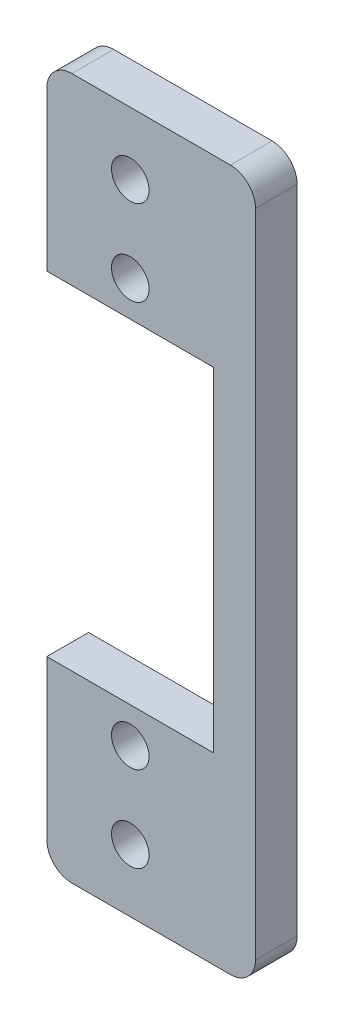
ISO-10303-21;
HEADER;
FILE_DESCRIPTION(('STEP AP214'),'2;1');
FILE_NAME('part.step','',(''),(''),'','','');
FILE_SCHEMA(('AUTOMOTIVE_DESIGN { 1 0 10303 214 1 1 1 1 }'));
ENDSEC;
DATA;
#1=APPLICATION_CONTEXT('core data for automotive mechanical design processes');
#2=APPLICATION_PROTOCOL_DEFINITION('international standard','automotive_design',2000,#1);
#3=PRODUCT_CONTEXT('',#1,'mechanical');
#4=PRODUCT('Part','Part','',(#3));
#5=PRODUCT_RELATED_PRODUCT_CATEGORY('part','',(#4));
#6=PRODUCT_DEFINITION_FORMATION('','',#4);
#7=PRODUCT_DEFINITION_CONTEXT('part definition',#1,'design');
#8=PRODUCT_DEFINITION('design','',#6,#7);
#9=PRODUCT_DEFINITION_SHAPE('','',#8);
#10=(LENGTH_UNIT() NAMED_UNIT(*) SI_UNIT(.MILLI.,.METRE.));
#11=(NAMED_UNIT(*) PLANE_ANGLE_UNIT() SI_UNIT($,.RADIAN.));
#12=(NAMED_UNIT(*) SI_UNIT($,.STERADIAN.) SOLID_ANGLE_UNIT());
#13=UNCERTAINTY_MEASURE_WITH_UNIT(LENGTH_MEASURE(1.E-05),#10,'distance_accuracy_value','');
#14=(GEOMETRIC_REPRESENTATION_CONTEXT(3) GLOBAL_UNCERTAINTY_ASSIGNED_CONTEXT((#13)) GLOBAL_UNIT_ASSIGNED_CONTEXT((#10,
#11,#12)) REPRESENTATION_CONTEXT('',''));
#15=CARTESIAN_POINT('',(0.,0.,0.));
#16=DIRECTION('',(0.,0.,1.));
#17=DIRECTION('',(1.,0.,0.));
#18=AXIS2_PLACEMENT_3D('',#15,#16,#17);
#19=CARTESIAN_POINT('',(-9.99999999999999,0.,5.));
#20=DIRECTION('',(-1.,0.,0.));
#21=DIRECTION('',(0.,0.,1.));
#22=AXIS2_PLACEMENT_3D('',#19,#20,#21);
#23=PLANE('',#22);
#24=DIRECTION('',(0.,1.,0.));
#25=VECTOR('',#24,1.);
#26=CARTESIAN_POINT('',(-9.99999999999999,0.,5.));
#27=LINE('',#26,#25);
#28=CARTESIAN_POINT('',(-9.99999999999999,20.,5.));
#29=VERTEX_POINT('',#28);
#30=CARTESIAN_POINT('',(-9.99999999999999,39.,5.));
#31=VERTEX_POINT('',#30);
#32=EDGE_CURVE('E126',#29,#31,#27,.T.);
#33=ORIENTED_EDGE('',*,*,#32,.T.);
#34=DIRECTION('',(0.,0.,-1.));
#35=VECTOR('',#34,1.);
#36=CARTESIAN_POINT('',(-9.99999999999999,39.,5.));
#37=LINE('',#36,#35);
#38=CARTESIAN_POINT('',(-9.99999999999999,39.,0.));
#39=VERTEX_POINT('',#38);
#40=EDGE_CURVE('E132',#31,#39,#37,.T.);
#41=ORIENTED_EDGE('',*,*,#40,.T.);
#42=DIRECTION('',(0.,1.,0.));
#43=VECTOR('',#42,1.);
#44=CARTESIAN_POINT('',(-9.99999999999999,0.,0.));
#45=LINE('',#44,#43);
#46=CARTESIAN_POINT('',(-9.99999999999999,20.,0.));
#47=VERTEX_POINT('',#46);
#48=EDGE_CURVE('E129',#47,#39,#45,.T.);
#49=ORIENTED_EDGE('',*,*,#48,.F.);
#50=DIRECTION('',(0.,0.,-1.));
#51=VECTOR('',#50,1.);
#52=CARTESIAN_POINT('',(-9.99999999999999,20.,5.));
#53=LINE('',#52,#51);
#54=EDGE_CURVE('E122',#29,#47,#53,.T.);
#55=ORIENTED_EDGE('',*,*,#54,.F.);
#56=EDGE_LOOP('',(#33,#41,#49,#55));
#57=FACE_BOUND('',#56,.T.);
#58=ADVANCED_FACE('F33',(#57),#23,.T.);
#59=CARTESIAN_POINT('',(0.,20.,5.));
#60=DIRECTION('',(0.,1.,0.));
#61=DIRECTION('',(-1.,0.,0.));
#62=AXIS2_PLACEMENT_3D('',#59,#60,#61);
#63=PLANE('',#62);
#64=DIRECTION('',(1.,0.,0.));
#65=VECTOR('',#64,1.);
#66=CARTESIAN_POINT('',(0.,20.,0.));
#67=LINE('',#66,#65);
#68=CARTESIAN_POINT('',(10.,20.,0.));
#69=VERTEX_POINT('',#68);
#70=EDGE_CURVE('E171',#47,#69,#67,.T.);
#71=ORIENTED_EDGE('',*,*,#70,.T.);
#72=DIRECTION('',(0.,0.,-1.));
#73=VECTOR('',#72,1.);
#74=CARTESIAN_POINT('',(10.,20.,5.));
#75=LINE('',#74,#73);
#76=CARTESIAN_POINT('',(10.,20.,5.));
#77=VERTEX_POINT('',#76);
#78=EDGE_CURVE('E133',#77,#69,#75,.T.);
#79=ORIENTED_EDGE('',*,*,#78,.F.);
#80=DIRECTION('',(1.,0.,0.));
#81=VECTOR('',#80,1.);
#82=CARTESIAN_POINT('',(0.,20.,5.));
#83=LINE('',#82,#81);
#84=EDGE_CURVE('E136',#29,#77,#83,.T.);
#85=ORIENTED_EDGE('',*,*,#84,.F.);
#86=ORIENTED_EDGE('',*,*,#54,.T.);
#87=EDGE_LOOP('',(#71,#79,#85,#86));
#88=FACE_BOUND('',#87,.T.);
#89=ADVANCED_FACE('F137',(#88),#63,.F.);
#90=CARTESIAN_POINT('',(10.,0.,5.));
#91=DIRECTION('',(1.,0.,0.));
#92=DIRECTION('',(0.,1.,0.));
#93=AXIS2_PLACEMENT_3D('',#90,#91,#92);
#94=PLANE('',#93);
#95=DIRECTION('',(0.,-1.,0.));
#96=VECTOR('',#95,1.);
#97=CARTESIAN_POINT('',(10.,0.,0.));
#98=LINE('',#97,#96);
#99=CARTESIAN_POINT('',(10.,-20.,0.));
#100=VERTEX_POINT('',#99);
#101=EDGE_CURVE('E173',#69,#100,#98,.T.);
#102=ORIENTED_EDGE('',*,*,#101,.T.);
#103=DIRECTION('',(0.,0.,-1.));
#104=VECTOR('',#103,1.);
#105=CARTESIAN_POINT('',(10.,-20.,5.));
#106=LINE('',#105,#104);
#107=CARTESIAN_POINT('',(10.,-20.,5.));
#108=VERTEX_POINT('',#107);
#109=EDGE_CURVE('E188',#108,#100,#106,.T.);
#110=ORIENTED_EDGE('',*,*,#109,.F.);
#111=DIRECTION('',(0.,-1.,0.));
#112=VECTOR('',#111,1.);
#113=CARTESIAN_POINT('',(10.,0.,5.));
#114=LINE('',#113,#112);
#115=EDGE_CURVE('E140',#77,#108,#114,.T.);
#116=ORIENTED_EDGE('',*,*,#115,.F.);
#117=ORIENTED_EDGE('',*,*,#78,.T.);
#118=EDGE_LOOP('',(#102,#110,#116,#117));
#119=FACE_BOUND('',#118,.T.);
#120=ADVANCED_FACE('F236',(#119),#94,.F.);
#121=CARTESIAN_POINT('',(0.,-20.,5.));
#122=DIRECTION('',(0.,1.,0.));
#123=DIRECTION('',(-1.,0.,0.));
#124=AXIS2_PLACEMENT_3D('',#121,#122,#123);
#125=PLANE('',#124);
#126=DIRECTION('',(1.,0.,0.));
#127=VECTOR('',#126,1.);
#128=CARTESIAN_POINT('',(0.,-20.,0.));
#129=LINE('',#128,#127);
#130=CARTESIAN_POINT('',(-9.99999999999999,-20.,0.));
#131=VERTEX_POINT('',#130);
#132=EDGE_CURVE('E176',#131,#100,#129,.T.);
#133=ORIENTED_EDGE('',*,*,#132,.F.);
#134=DIRECTION('',(0.,0.,-1.));
#135=VECTOR('',#134,1.);
#136=CARTESIAN_POINT('',(-9.99999999999999,-20.,5.));
#137=LINE('',#136,#135);
#138=CARTESIAN_POINT('',(-9.99999999999999,-20.,5.));
#139=VERTEX_POINT('',#138);
#140=EDGE_CURVE('E169',#139,#131,#137,.T.);
#141=ORIENTED_EDGE('',*,*,#140,.F.);
#142=DIRECTION('',(1.,0.,0.));
#143=VECTOR('',#142,1.);
#144=CARTESIAN_POINT('',(0.,-20.,5.));
#145=LINE('',#144,#143);
#146=EDGE_CURVE('E156',#139,#108,#145,.T.);
#147=ORIENTED_EDGE('',*,*,#146,.T.);
#148=ORIENTED_EDGE('',*,*,#109,.T.);
#149=EDGE_LOOP('',(#133,#141,#147,#148));
#150=FACE_BOUND('',#149,.T.);
#151=ADVANCED_FACE('F243',(#150),#125,.T.);
#152=CARTESIAN_POINT('',(-9.99999999999999,0.,5.));
#153=DIRECTION('',(1.,0.,0.));
#154=DIRECTION('',(0.,0.,-1.));
#155=AXIS2_PLACEMENT_3D('',#152,#153,#154);
#156=PLANE('',#155);
#157=DIRECTION('',(0.,-1.,0.));
#158=VECTOR('',#157,1.);
#159=CARTESIAN_POINT('',(-9.99999999999999,0.,0.));
#160=LINE('',#159,#158);
#161=CARTESIAN_POINT('',(-9.99999999999999,-39.,0.));
#162=VERTEX_POINT('',#161);
#163=EDGE_CURVE('E179',#131,#162,#160,.T.);
#164=ORIENTED_EDGE('',*,*,#163,.T.);
#165=DIRECTION('',(0.,0.,-1.));
#166=VECTOR('',#165,1.);
#167=CARTESIAN_POINT('',(-9.99999999999999,-39.,5.));
#168=LINE('',#167,#166);
#169=CARTESIAN_POINT('',(-9.99999999999999,-39.,5.));
#170=VERTEX_POINT('',#169);
#171=EDGE_CURVE('E216',#162,#170,#168,.F.);
#172=ORIENTED_EDGE('',*,*,#171,.T.);
#173=DIRECTION('',(0.,-1.,0.));
#174=VECTOR('',#173,1.);
#175=CARTESIAN_POINT('',(-9.99999999999999,0.,5.));
#176=LINE('',#175,#174);
#177=EDGE_CURVE('E159',#139,#170,#176,.T.);
#178=ORIENTED_EDGE('',*,*,#177,.F.);
#179=ORIENTED_EDGE('',*,*,#140,.T.);
#180=EDGE_LOOP('',(#164,#172,#178,#179));
#181=FACE_BOUND('',#180,.T.);
#182=ADVANCED_FACE('F246',(#181),#156,.F.);
#183=CARTESIAN_POINT('',(0.,-42.,5.));
#184=DIRECTION('',(0.,1.,0.));
#185=DIRECTION('',(-1.,0.,0.));
#186=AXIS2_PLACEMENT_3D('',#183,#184,#185);
#187=PLANE('',#186);
#188=DIRECTION('',(1.,0.,0.));
#189=VECTOR('',#188,1.);
#190=CARTESIAN_POINT('',(0.,-42.,5.));
#191=LINE('',#190,#189);
#192=CARTESIAN_POINT('',(-6.99999999999999,-42.,5.));
#193=VERTEX_POINT('',#192);
#194=CARTESIAN_POINT('',(12.,-42.,5.));
#195=VERTEX_POINT('',#194);
#196=EDGE_CURVE('E162',#193,#195,#191,.T.);
#197=ORIENTED_EDGE('',*,*,#196,.F.);
#198=DIRECTION('',(0.,0.,-1.));
#199=VECTOR('',#198,1.);
#200=CARTESIAN_POINT('',(-6.99999999999999,-42.,5.));
#201=LINE('',#200,#199);
#202=CARTESIAN_POINT('',(-6.99999999999999,-42.,0.));
#203=VERTEX_POINT('',#202);
#204=EDGE_CURVE('E213',#193,#203,#201,.T.);
#205=ORIENTED_EDGE('',*,*,#204,.T.);
#206=DIRECTION('',(1.,0.,0.));
#207=VECTOR('',#206,1.);
#208=CARTESIAN_POINT('',(0.,-42.,0.));
#209=LINE('',#208,#207);
#210=CARTESIAN_POINT('',(12.,-42.,0.));
#211=VERTEX_POINT('',#210);
#212=EDGE_CURVE('E182',#203,#211,#209,.T.);
#213=ORIENTED_EDGE('',*,*,#212,.T.);
#214=DIRECTION('',(0.,0.,-1.));
#215=VECTOR('',#214,1.);
#216=CARTESIAN_POINT('',(12.,-42.,5.));
#217=LINE('',#216,#215);
#218=EDGE_CURVE('E211',#211,#195,#217,.F.);
#219=ORIENTED_EDGE('',*,*,#218,.T.);
#220=EDGE_LOOP('',(#197,#205,#213,#219));
#221=FACE_BOUND('',#220,.T.);
#222=ADVANCED_FACE('F253',(#221),#187,.F.);
#223=CARTESIAN_POINT('',(15.,0.,5.));
#224=DIRECTION('',(1.,0.,0.));
#225=DIRECTION('',(0.,0.,-1.));
#226=AXIS2_PLACEMENT_3D('',#223,#224,#225);
#227=PLANE('',#226);
#228=DIRECTION('',(0.,-1.,0.));
#229=VECTOR('',#228,1.);
#230=CARTESIAN_POINT('',(15.,0.,0.));
#231=LINE('',#230,#229);
#232=CARTESIAN_POINT('',(15.,39.,0.));
#233=VERTEX_POINT('',#232);
#234=CARTESIAN_POINT('',(15.,-39.,0.));
#235=VERTEX_POINT('',#234);
#236=EDGE_CURVE('E149',#233,#235,#231,.T.);
#237=ORIENTED_EDGE('',*,*,#236,.F.);
#238=DIRECTION('',(0.,0.,-1.));
#239=VECTOR('',#238,1.);
#240=CARTESIAN_POINT('',(15.,39.,5.));
#241=LINE('',#240,#239);
#242=CARTESIAN_POINT('',(15.,39.,5.));
#243=VERTEX_POINT('',#242);
#244=EDGE_CURVE('E11',#233,#243,#241,.F.);
#245=ORIENTED_EDGE('',*,*,#244,.T.);
#246=DIRECTION('',(0.,-1.,0.));
#247=VECTOR('',#246,1.);
#248=CARTESIAN_POINT('',(15.,0.,5.));
#249=LINE('',#248,#247);
#250=CARTESIAN_POINT('',(15.,-39.,5.));
#251=VERTEX_POINT('',#250);
#252=EDGE_CURVE('E164',#243,#251,#249,.T.);
#253=ORIENTED_EDGE('',*,*,#252,.T.);
#254=DIRECTION('',(0.,0.,-1.));
#255=VECTOR('',#254,1.);
#256=CARTESIAN_POINT('',(15.,-39.,0.));
#257=LINE('',#256,#255);
#258=EDGE_CURVE('E41',#251,#235,#257,.T.);
#259=ORIENTED_EDGE('',*,*,#258,.T.);
#260=EDGE_LOOP('',(#237,#245,#253,#259));
#261=FACE_BOUND('',#260,.T.);
#262=ADVANCED_FACE('F219',(#261),#227,.T.);
#263=CARTESIAN_POINT('',(0.,42.,5.));
#264=DIRECTION('',(0.,1.,0.));
#265=DIRECTION('',(0.,0.,1.));
#266=AXIS2_PLACEMENT_3D('',#263,#264,#265);
#267=PLANE('',#266);
#268=DIRECTION('',(1.,0.,0.));
#269=VECTOR('',#268,1.);
#270=CARTESIAN_POINT('',(0.,42.,0.));
#271=LINE('',#270,#269);
#272=CARTESIAN_POINT('',(-6.99999999999999,42.,0.));
#273=VERTEX_POINT('',#272);
#274=CARTESIAN_POINT('',(12.,42.,0.));
#275=VERTEX_POINT('',#274);
#276=EDGE_CURVE('E146',#273,#275,#271,.T.);
#277=ORIENTED_EDGE('',*,*,#276,.F.);
#278=DIRECTION('',(0.,0.,-1.));
#279=VECTOR('',#278,1.);
#280=CARTESIAN_POINT('',(-6.99999999999999,42.,5.));
#281=LINE('',#280,#279);
#282=CARTESIAN_POINT('',(-6.99999999999999,42.,5.));
#283=VERTEX_POINT('',#282);
#284=EDGE_CURVE('E203',#273,#283,#281,.F.);
#285=ORIENTED_EDGE('',*,*,#284,.T.);
#286=DIRECTION('',(1.,0.,0.));
#287=VECTOR('',#286,1.);
#288=CARTESIAN_POINT('',(0.,42.,5.));
#289=LINE('',#288,#287);
#290=CARTESIAN_POINT('',(12.,42.,5.));
#291=VERTEX_POINT('',#290);
#292=EDGE_CURVE('E166',#283,#291,#289,.T.);
#293=ORIENTED_EDGE('',*,*,#292,.T.);
#294=DIRECTION('',(0.,0.,-1.));
#295=VECTOR('',#294,1.);
#296=CARTESIAN_POINT('',(12.,42.,5.));
#297=LINE('',#296,#295);
#298=EDGE_CURVE('E200',#291,#275,#297,.T.);
#299=ORIENTED_EDGE('',*,*,#298,.T.);
#300=EDGE_LOOP('',(#277,#285,#293,#299));
#301=FACE_BOUND('',#300,.T.);
#302=ADVANCED_FACE('F230',(#301),#267,.T.);
#303=CARTESIAN_POINT('',(0.,0.,5.));
#304=DIRECTION('',(0.,0.,1.));
#305=DIRECTION('',(1.,0.,0.));
#306=AXIS2_PLACEMENT_3D('',#303,#304,#305);
#307=PLANE('',#306);
#308=CARTESIAN_POINT('',(0.,24.25,5.));
#309=DIRECTION('',(0.,0.,-1.));
#310=DIRECTION('',(-1.,0.,0.));
#311=AXIS2_PLACEMENT_3D('',#308,#309,#310);
#312=CIRCLE('',#311,2.25);
#313=CARTESIAN_POINT('',(-2.25,24.25,5.));
#314=VERTEX_POINT('',#313);
#315=EDGE_CURVE('E429',#314,#314,#312,.T.);
#316=ORIENTED_EDGE('',*,*,#315,.T.);
#317=EDGE_LOOP('',(#316));
#318=FACE_BOUND('',#317,.T.);
#319=CARTESIAN_POINT('',(0.,-24.25,5.));
#320=DIRECTION('',(0.,0.,-1.));
#321=DIRECTION('',(-1.,0.,0.));
#322=AXIS2_PLACEMENT_3D('',#319,#320,#321);
#323=CIRCLE('',#322,2.25);
#324=CARTESIAN_POINT('',(-2.25,-24.25,5.));
#325=VERTEX_POINT('',#324);
#326=EDGE_CURVE('E423',#325,#325,#323,.T.);
#327=ORIENTED_EDGE('',*,*,#326,.T.);
#328=EDGE_LOOP('',(#327));
#329=FACE_BOUND('',#328,.T.);
#330=CARTESIAN_POINT('',(0.,34.5,5.));
#331=DIRECTION('',(0.,0.,-1.));
#332=DIRECTION('',(-1.,0.,0.));
#333=AXIS2_PLACEMENT_3D('',#330,#331,#332);
#334=CIRCLE('',#333,2.25);
#335=CARTESIAN_POINT('',(-2.24999999999999,34.5,5.));
#336=VERTEX_POINT('',#335);
#337=EDGE_CURVE('E416',#336,#336,#334,.T.);
#338=ORIENTED_EDGE('',*,*,#337,.T.);
#339=EDGE_LOOP('',(#338));
#340=FACE_BOUND('',#339,.T.);
#341=CARTESIAN_POINT('',(0.,-34.5,5.));
#342=DIRECTION('',(0.,0.,-1.));
#343=DIRECTION('',(-1.,0.,0.));
#344=AXIS2_PLACEMENT_3D('',#341,#342,#343);
#345=CIRCLE('',#344,2.25);
#346=CARTESIAN_POINT('',(-2.24999999999999,-34.5,5.));
#347=VERTEX_POINT('',#346);
#348=EDGE_CURVE('E152',#347,#347,#345,.T.);
#349=ORIENTED_EDGE('',*,*,#348,.T.);
#350=EDGE_LOOP('',(#349));
#351=FACE_BOUND('',#350,.T.);
#352=ORIENTED_EDGE('',*,*,#292,.F.);
#353=CARTESIAN_POINT('',(-6.99999999999999,39.,5.));
#354=DIRECTION('',(0.,0.,1.));
#355=DIRECTION('',(1.,0.,0.));
#356=AXIS2_PLACEMENT_3D('',#353,#354,#355);
#357=CIRCLE('',#356,3.);
#358=EDGE_CURVE('E145',#283,#31,#357,.T.);
#359=ORIENTED_EDGE('',*,*,#358,.T.);
#360=ORIENTED_EDGE('',*,*,#32,.F.);
#361=ORIENTED_EDGE('',*,*,#84,.T.);
#362=ORIENTED_EDGE('',*,*,#115,.T.);
#363=ORIENTED_EDGE('',*,*,#146,.F.);
#364=ORIENTED_EDGE('',*,*,#177,.T.);
#365=CARTESIAN_POINT('',(-6.99999999999999,-39.,5.));
#366=DIRECTION('',(0.,0.,1.));
#367=DIRECTION('',(1.,0.,0.));
#368=AXIS2_PLACEMENT_3D('',#365,#366,#367);
#369=CIRCLE('',#368,3.);
#370=EDGE_CURVE('E208',#170,#193,#369,.T.);
#371=ORIENTED_EDGE('',*,*,#370,.T.);
#372=ORIENTED_EDGE('',*,*,#196,.T.);
#373=CARTESIAN_POINT('',(12.,-39.,5.));
#374=DIRECTION('',(0.,0.,1.));
#375=DIRECTION('',(1.,0.,0.));
#376=AXIS2_PLACEMENT_3D('',#373,#374,#375);
#377=CIRCLE('',#376,3.);
#378=EDGE_CURVE('E48',#195,#251,#377,.T.);
#379=ORIENTED_EDGE('',*,*,#378,.T.);
#380=ORIENTED_EDGE('',*,*,#252,.F.);
#381=CARTESIAN_POINT('',(12.,39.,5.));
#382=DIRECTION('',(0.,0.,1.));
#383=DIRECTION('',(1.,0.,0.));
#384=AXIS2_PLACEMENT_3D('',#381,#382,#383);
#385=CIRCLE('',#384,3.);
#386=EDGE_CURVE('E206',#243,#291,#385,.T.);
#387=ORIENTED_EDGE('',*,*,#386,.T.);
#388=EDGE_LOOP('',(#352,#359,#360,#361,#362,#363,#364,#371,#372,#379,#380,#387));
#389=FACE_BOUND('',#388,.T.);
#390=ADVANCED_FACE('F143',(#318,#329,#340,#351,#389),#307,.T.);
#391=CARTESIAN_POINT('',(0.,0.,0.));
#392=DIRECTION('',(0.,0.,1.));
#393=DIRECTION('',(1.,0.,0.));
#394=AXIS2_PLACEMENT_3D('',#391,#392,#393);
#395=PLANE('',#394);
#396=CARTESIAN_POINT('',(0.,24.25,0.));
#397=DIRECTION('',(0.,0.,-1.));
#398=DIRECTION('',(-1.,0.,0.));
#399=AXIS2_PLACEMENT_3D('',#396,#397,#398);
#400=CIRCLE('',#399,2.25);
#401=CARTESIAN_POINT('',(-2.25,24.25,0.));
#402=VERTEX_POINT('',#401);
#403=EDGE_CURVE('E432',#402,#402,#400,.T.);
#404=ORIENTED_EDGE('',*,*,#403,.F.);
#405=EDGE_LOOP('',(#404));
#406=FACE_BOUND('',#405,.T.);
#407=CARTESIAN_POINT('',(0.,-24.25,0.));
#408=DIRECTION('',(0.,0.,-1.));
#409=DIRECTION('',(-1.,0.,0.));
#410=AXIS2_PLACEMENT_3D('',#407,#408,#409);
#411=CIRCLE('',#410,2.25);
#412=CARTESIAN_POINT('',(-2.25,-24.25,0.));
#413=VERTEX_POINT('',#412);
#414=EDGE_CURVE('E426',#413,#413,#411,.T.);
#415=ORIENTED_EDGE('',*,*,#414,.F.);
#416=EDGE_LOOP('',(#415));
#417=FACE_BOUND('',#416,.T.);
#418=CARTESIAN_POINT('',(0.,34.5,0.));
#419=DIRECTION('',(0.,0.,-1.));
#420=DIRECTION('',(-1.,0.,0.));
#421=AXIS2_PLACEMENT_3D('',#418,#419,#420);
#422=CIRCLE('',#421,2.25);
#423=CARTESIAN_POINT('',(-2.25,34.5,0.));
#424=VERTEX_POINT('',#423);
#425=EDGE_CURVE('E418',#424,#424,#422,.T.);
#426=ORIENTED_EDGE('',*,*,#425,.F.);
#427=EDGE_LOOP('',(#426));
#428=FACE_BOUND('',#427,.T.);
#429=CARTESIAN_POINT('',(0.,-34.5,0.));
#430=DIRECTION('',(0.,0.,-1.));
#431=DIRECTION('',(-1.,0.,0.));
#432=AXIS2_PLACEMENT_3D('',#429,#430,#431);
#433=CIRCLE('',#432,2.25);
#434=CARTESIAN_POINT('',(-2.24999999999999,-34.5,0.));
#435=VERTEX_POINT('',#434);
#436=EDGE_CURVE('E414',#435,#435,#433,.T.);
#437=ORIENTED_EDGE('',*,*,#436,.F.);
#438=EDGE_LOOP('',(#437));
#439=FACE_BOUND('',#438,.T.);
#440=ORIENTED_EDGE('',*,*,#48,.T.);
#441=CARTESIAN_POINT('',(-6.99999999999999,39.,0.));
#442=DIRECTION('',(0.,0.,1.));
#443=DIRECTION('',(1.,0.,0.));
#444=AXIS2_PLACEMENT_3D('',#441,#442,#443);
#445=CIRCLE('',#444,3.);
#446=EDGE_CURVE('E198',#39,#273,#445,.F.);
#447=ORIENTED_EDGE('',*,*,#446,.T.);
#448=ORIENTED_EDGE('',*,*,#276,.T.);
#449=CARTESIAN_POINT('',(12.,39.,0.));
#450=DIRECTION('',(0.,0.,1.));
#451=DIRECTION('',(1.,0.,0.));
#452=AXIS2_PLACEMENT_3D('',#449,#450,#451);
#453=CIRCLE('',#452,3.);
#454=EDGE_CURVE('E194',#275,#233,#453,.F.);
#455=ORIENTED_EDGE('',*,*,#454,.T.);
#456=ORIENTED_EDGE('',*,*,#236,.T.);
#457=CARTESIAN_POINT('',(12.,-39.,0.));
#458=DIRECTION('',(0.,0.,1.));
#459=DIRECTION('',(1.,0.,0.));
#460=AXIS2_PLACEMENT_3D('',#457,#458,#459);
#461=CIRCLE('',#460,3.);
#462=EDGE_CURVE('E192',#235,#211,#461,.F.);
#463=ORIENTED_EDGE('',*,*,#462,.T.);
#464=ORIENTED_EDGE('',*,*,#212,.F.);
#465=CARTESIAN_POINT('',(-6.99999999999999,-39.,0.));
#466=DIRECTION('',(0.,0.,1.));
#467=DIRECTION('',(1.,0.,0.));
#468=AXIS2_PLACEMENT_3D('',#465,#466,#467);
#469=CIRCLE('',#468,3.);
#470=EDGE_CURVE('E196',#203,#162,#469,.F.);
#471=ORIENTED_EDGE('',*,*,#470,.T.);
#472=ORIENTED_EDGE('',*,*,#163,.F.);
#473=ORIENTED_EDGE('',*,*,#132,.T.);
#474=ORIENTED_EDGE('',*,*,#101,.F.);
#475=ORIENTED_EDGE('',*,*,#70,.F.);
#476=EDGE_LOOP('',(#440,#447,#448,#455,#456,#463,#464,#471,#472,#473,#474,#475));
#477=FACE_BOUND('',#476,.T.);
#478=ADVANCED_FACE('F222',(#406,#417,#428,#439,#477),#395,.F.);
#479=CARTESIAN_POINT('',(0.,-34.5,0.));
#480=DIRECTION('',(0.,0.,-1.));
#481=DIRECTION('',(-1.,0.,0.));
#482=AXIS2_PLACEMENT_3D('',#479,#480,#481);
#483=CYLINDRICAL_SURFACE('',#482,2.25);
#484=ORIENTED_EDGE('',*,*,#348,.F.);
#485=EDGE_LOOP('',(#484));
#486=FACE_BOUND('',#485,.T.);
#487=ORIENTED_EDGE('',*,*,#436,.T.);
#488=EDGE_LOOP('',(#487));
#489=FACE_BOUND('',#488,.T.);
#490=ADVANCED_FACE('F310',(#486,#489),#483,.F.);
#491=CARTESIAN_POINT('',(0.,34.5,0.));
#492=DIRECTION('',(0.,0.,-1.));
#493=DIRECTION('',(-1.,0.,0.));
#494=AXIS2_PLACEMENT_3D('',#491,#492,#493);
#495=CYLINDRICAL_SURFACE('',#494,2.25);
#496=ORIENTED_EDGE('',*,*,#337,.F.);
#497=EDGE_LOOP('',(#496));
#498=FACE_BOUND('',#497,.T.);
#499=ORIENTED_EDGE('',*,*,#425,.T.);
#500=EDGE_LOOP('',(#499));
#501=FACE_BOUND('',#500,.T.);
#502=ADVANCED_FACE('F274',(#498,#501),#495,.F.);
#503=CARTESIAN_POINT('',(-6.99999999999999,39.,5.));
#504=DIRECTION('',(0.,0.,-1.));
#505=DIRECTION('',(-1.,0.,0.));
#506=AXIS2_PLACEMENT_3D('',#503,#504,#505);
#507=CYLINDRICAL_SURFACE('',#506,3.);
#508=ORIENTED_EDGE('',*,*,#358,.F.);
#509=ORIENTED_EDGE('',*,*,#284,.F.);
#510=ORIENTED_EDGE('',*,*,#446,.F.);
#511=ORIENTED_EDGE('',*,*,#40,.F.);
#512=EDGE_LOOP('',(#508,#509,#510,#511));
#513=FACE_BOUND('',#512,.T.);
#514=ADVANCED_FACE('F233',(#513),#507,.T.);
#515=CARTESIAN_POINT('',(-6.99999999999999,-39.,5.));
#516=DIRECTION('',(0.,0.,-1.));
#517=DIRECTION('',(-1.,0.,0.));
#518=AXIS2_PLACEMENT_3D('',#515,#516,#517);
#519=CYLINDRICAL_SURFACE('',#518,3.);
#520=ORIENTED_EDGE('',*,*,#370,.F.);
#521=ORIENTED_EDGE('',*,*,#171,.F.);
#522=ORIENTED_EDGE('',*,*,#470,.F.);
#523=ORIENTED_EDGE('',*,*,#204,.F.);
#524=EDGE_LOOP('',(#520,#521,#522,#523));
#525=FACE_BOUND('',#524,.T.);
#526=ADVANCED_FACE('F249',(#525),#519,.T.);
#527=CARTESIAN_POINT('',(12.,39.,5.));
#528=DIRECTION('',(0.,0.,-1.));
#529=DIRECTION('',(-1.,0.,0.));
#530=AXIS2_PLACEMENT_3D('',#527,#528,#529);
#531=CYLINDRICAL_SURFACE('',#530,3.);
#532=ORIENTED_EDGE('',*,*,#386,.F.);
#533=ORIENTED_EDGE('',*,*,#244,.F.);
#534=ORIENTED_EDGE('',*,*,#454,.F.);
#535=ORIENTED_EDGE('',*,*,#298,.F.);
#536=EDGE_LOOP('',(#532,#533,#534,#535));
#537=FACE_BOUND('',#536,.T.);
#538=ADVANCED_FACE('F228',(#537),#531,.T.);
#539=CARTESIAN_POINT('',(12.,-39.,5.));
#540=DIRECTION('',(0.,0.,1.));
#541=DIRECTION('',(1.,0.,0.));
#542=AXIS2_PLACEMENT_3D('',#539,#540,#541);
#543=CYLINDRICAL_SURFACE('',#542,3.);
#544=ORIENTED_EDGE('',*,*,#378,.F.);
#545=ORIENTED_EDGE('',*,*,#218,.F.);
#546=ORIENTED_EDGE('',*,*,#462,.F.);
#547=ORIENTED_EDGE('',*,*,#258,.F.);
#548=EDGE_LOOP('',(#544,#545,#546,#547));
#549=FACE_BOUND('',#548,.T.);
#550=ADVANCED_FACE('F35',(#549),#543,.T.);
#551=CARTESIAN_POINT('',(0.,-24.25,0.));
#552=DIRECTION('',(0.,0.,-1.));
#553=DIRECTION('',(-1.,0.,0.));
#554=AXIS2_PLACEMENT_3D('',#551,#552,#553);
#555=CYLINDRICAL_SURFACE('',#554,2.25);
#556=ORIENTED_EDGE('',*,*,#326,.F.);
#557=EDGE_LOOP('',(#556));
#558=FACE_BOUND('',#557,.T.);
#559=ORIENTED_EDGE('',*,*,#414,.T.);
#560=EDGE_LOOP('',(#559));
#561=FACE_BOUND('',#560,.T.);
#562=ADVANCED_FACE('F256',(#558,#561),#555,.F.);
#563=CARTESIAN_POINT('',(0.,24.25,0.));
#564=DIRECTION('',(0.,0.,-1.));
#565=DIRECTION('',(-1.,0.,0.));
#566=AXIS2_PLACEMENT_3D('',#563,#564,#565);
#567=CYLINDRICAL_SURFACE('',#566,2.25);
#568=ORIENTED_EDGE('',*,*,#315,.F.);
#569=EDGE_LOOP('',(#568));
#570=FACE_BOUND('',#569,.T.);
#571=ORIENTED_EDGE('',*,*,#403,.T.);
#572=EDGE_LOOP('',(#571));
#573=FACE_BOUND('',#572,.T.);
#574=ADVANCED_FACE('F261',(#570,#573),#567,.F.);
#575=CLOSED_SHELL('',(#58,#89,#120,#151,#182,#222,#262,#302,#390,#478,#490,#502,#514,#526,#538,
#550,#562,#574));
#576=MANIFOLD_SOLID_BREP('B2',#575);
#577=ADVANCED_BREP_SHAPE_REPRESENTATION('',(#18,#576),#14);
#578=SHAPE_DEFINITION_REPRESENTATION(#9,#577);
ENDSEC;
END-ISO-10303-21;
